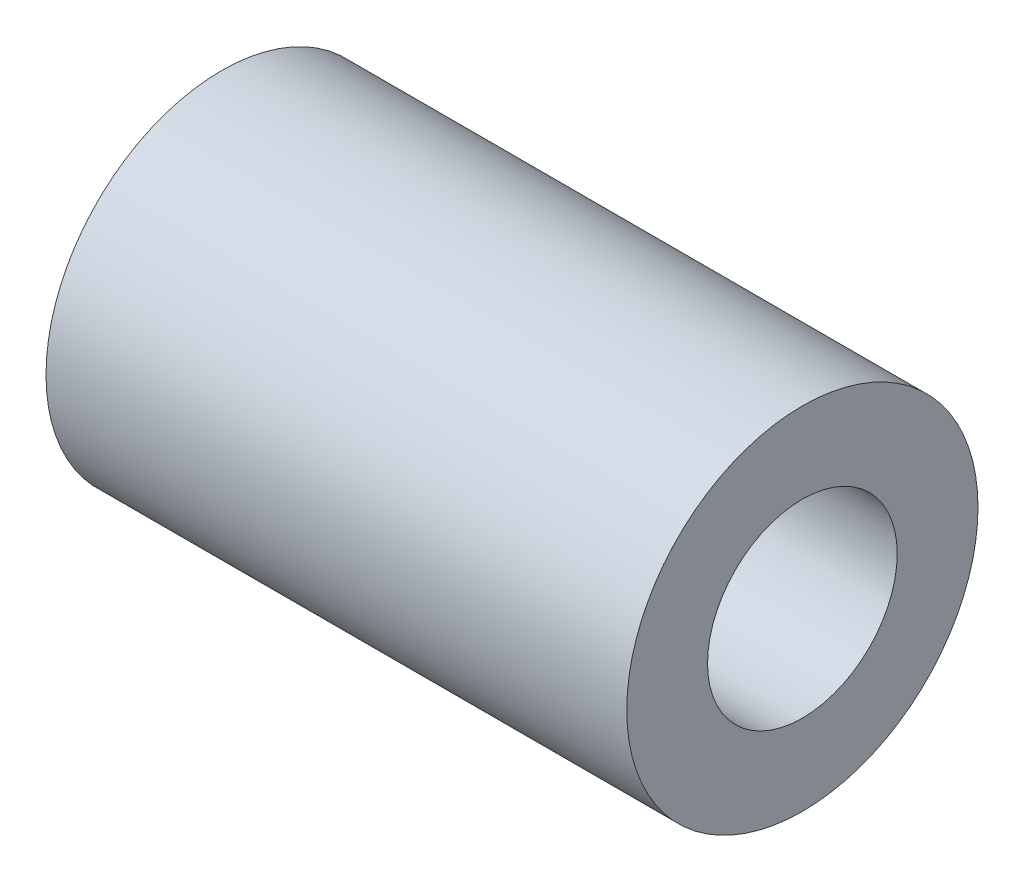
ISO-10303-21;
HEADER;
FILE_DESCRIPTION(('STEP AP214'),'2;1');
FILE_NAME('part.step','',(''),(''),'','','');
FILE_SCHEMA(('AUTOMOTIVE_DESIGN { 1 0 10303 214 1 1 1 1 }'));
ENDSEC;
DATA;
#1=APPLICATION_CONTEXT('core data for automotive mechanical design processes');
#2=APPLICATION_PROTOCOL_DEFINITION('international standard','automotive_design',2000,#1);
#3=PRODUCT_CONTEXT('',#1,'mechanical');
#4=PRODUCT('Part','Part','',(#3));
#5=PRODUCT_RELATED_PRODUCT_CATEGORY('part','',(#4));
#6=PRODUCT_DEFINITION_FORMATION('','',#4);
#7=PRODUCT_DEFINITION_CONTEXT('part definition',#1,'design');
#8=PRODUCT_DEFINITION('design','',#6,#7);
#9=PRODUCT_DEFINITION_SHAPE('','',#8);
#10=(LENGTH_UNIT() NAMED_UNIT(*) SI_UNIT(.MILLI.,.METRE.));
#11=(NAMED_UNIT(*) PLANE_ANGLE_UNIT() SI_UNIT($,.RADIAN.));
#12=(NAMED_UNIT(*) SI_UNIT($,.STERADIAN.) SOLID_ANGLE_UNIT());
#13=UNCERTAINTY_MEASURE_WITH_UNIT(LENGTH_MEASURE(1.E-05),#10,'distance_accuracy_value','');
#14=(GEOMETRIC_REPRESENTATION_CONTEXT(3) GLOBAL_UNCERTAINTY_ASSIGNED_CONTEXT((#13)) GLOBAL_UNIT_ASSIGNED_CONTEXT((#10,
#11,#12)) REPRESENTATION_CONTEXT('',''));
#15=CARTESIAN_POINT('',(0.,0.,0.));
#16=DIRECTION('',(0.,0.,1.));
#17=DIRECTION('',(1.,0.,0.));
#18=AXIS2_PLACEMENT_3D('',#15,#16,#17);
#19=CARTESIAN_POINT('',(-21.,0.,0.));
#20=DIRECTION('',(1.,0.,0.));
#21=DIRECTION('',(0.,0.,-1.));
#22=AXIS2_PLACEMENT_3D('',#19,#20,#21);
#23=CYLINDRICAL_SURFACE('',#22,6.35);
#24=CARTESIAN_POINT('',(-21.,0.,0.));
#25=DIRECTION('',(1.,0.,0.));
#26=DIRECTION('',(0.,0.,-1.));
#27=AXIS2_PLACEMENT_3D('',#24,#25,#26);
#28=CIRCLE('',#27,6.35);
#29=CARTESIAN_POINT('',(-21.,0.,-6.35));
#30=VERTEX_POINT('',#29);
#31=EDGE_CURVE('E10',#30,#30,#28,.T.);
#32=ORIENTED_EDGE('',*,*,#31,.T.);
#33=EDGE_LOOP('',(#32));
#34=FACE_BOUND('',#33,.T.);
#35=CARTESIAN_POINT('',(0.,0.,0.));
#36=DIRECTION('',(1.,0.,0.));
#37=DIRECTION('',(0.,0.,-1.));
#38=AXIS2_PLACEMENT_3D('',#35,#36,#37);
#39=CIRCLE('',#38,6.35);
#40=CARTESIAN_POINT('',(0.,0.,-6.35));
#41=VERTEX_POINT('',#40);
#42=EDGE_CURVE('E34',#41,#41,#39,.T.);
#43=ORIENTED_EDGE('',*,*,#42,.F.);
#44=EDGE_LOOP('',(#43));
#45=FACE_BOUND('',#44,.T.);
#46=ADVANCED_FACE('F31',(#34,#45),#23,.T.);
#47=CARTESIAN_POINT('',(-21.,0.,0.));
#48=DIRECTION('',(1.,0.,0.));
#49=DIRECTION('',(0.,0.,-1.));
#50=AXIS2_PLACEMENT_3D('',#47,#48,#49);
#51=PLANE('',#50);
#52=CARTESIAN_POINT('',(-21.,0.,0.));
#53=DIRECTION('',(1.,0.,0.));
#54=DIRECTION('',(0.,0.,-1.));
#55=AXIS2_PLACEMENT_3D('',#52,#53,#54);
#56=CIRCLE('',#55,3.429);
#57=CARTESIAN_POINT('',(-21.,0.,-3.429));
#58=VERTEX_POINT('',#57);
#59=EDGE_CURVE('E41',#58,#58,#56,.T.);
#60=ORIENTED_EDGE('',*,*,#59,.T.);
#61=EDGE_LOOP('',(#60));
#62=FACE_BOUND('',#61,.T.);
#63=ORIENTED_EDGE('',*,*,#31,.F.);
#64=EDGE_LOOP('',(#63));
#65=FACE_BOUND('',#64,.T.);
#66=ADVANCED_FACE('F49',(#62,#65),#51,.F.);
#67=CARTESIAN_POINT('',(0.,0.,0.));
#68=DIRECTION('',(1.,0.,0.));
#69=DIRECTION('',(0.,0.,-1.));
#70=AXIS2_PLACEMENT_3D('',#67,#68,#69);
#71=PLANE('',#70);
#72=CARTESIAN_POINT('',(0.,0.,0.));
#73=DIRECTION('',(1.,0.,0.));
#74=DIRECTION('',(0.,0.,-1.));
#75=AXIS2_PLACEMENT_3D('',#72,#73,#74);
#76=CIRCLE('',#75,3.429);
#77=CARTESIAN_POINT('',(0.,0.,-3.429));
#78=VERTEX_POINT('',#77);
#79=EDGE_CURVE('E43',#78,#78,#76,.T.);
#80=ORIENTED_EDGE('',*,*,#79,.F.);
#81=EDGE_LOOP('',(#80));
#82=FACE_BOUND('',#81,.T.);
#83=ORIENTED_EDGE('',*,*,#42,.T.);
#84=EDGE_LOOP('',(#83));
#85=FACE_BOUND('',#84,.T.);
#86=ADVANCED_FACE('F55',(#82,#85),#71,.T.);
#87=CARTESIAN_POINT('',(-21.,0.,0.));
#88=DIRECTION('',(1.,0.,0.));
#89=DIRECTION('',(0.,0.,-1.));
#90=AXIS2_PLACEMENT_3D('',#87,#88,#89);
#91=CYLINDRICAL_SURFACE('',#90,3.429);
#92=ORIENTED_EDGE('',*,*,#59,.F.);
#93=EDGE_LOOP('',(#92));
#94=FACE_BOUND('',#93,.T.);
#95=ORIENTED_EDGE('',*,*,#79,.T.);
#96=EDGE_LOOP('',(#95));
#97=FACE_BOUND('',#96,.T.);
#98=ADVANCED_FACE('F52',(#94,#97),#91,.F.);
#99=CLOSED_SHELL('',(#46,#66,#86,#98));
#100=MANIFOLD_SOLID_BREP('B2',#99);
#101=ADVANCED_BREP_SHAPE_REPRESENTATION('',(#18,#100),#14);
#102=SHAPE_DEFINITION_REPRESENTATION(#9,#101);
ENDSEC;
END-ISO-10303-21;
